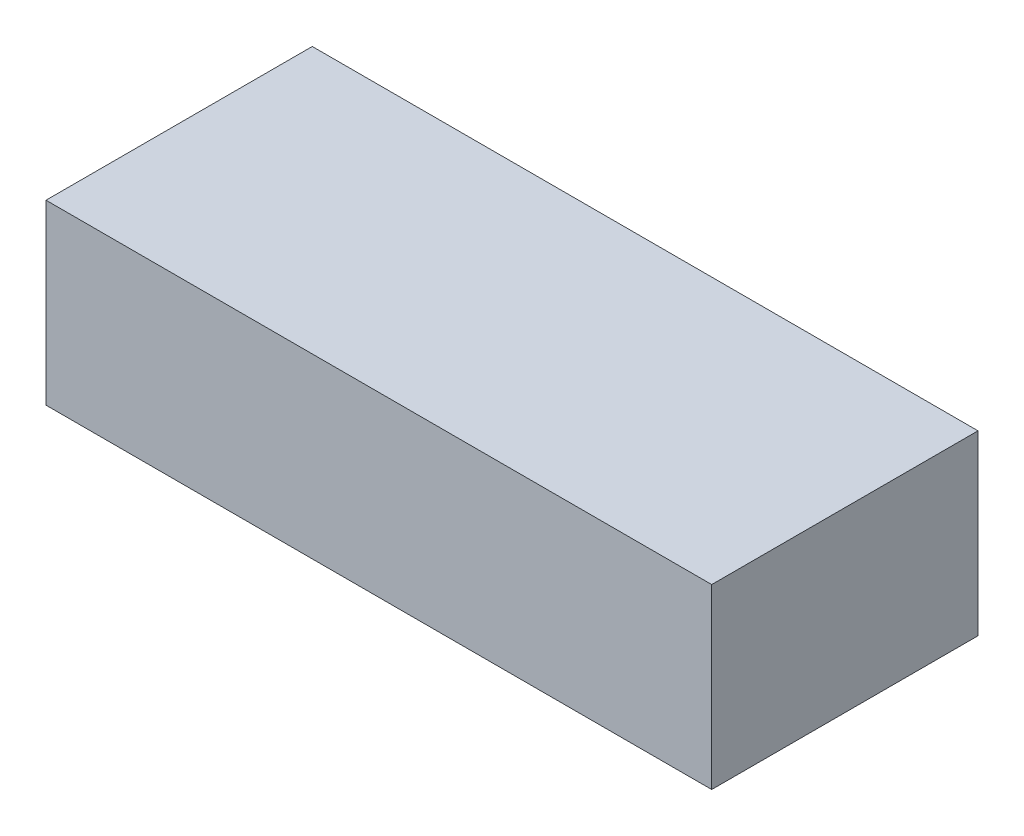
ISO-10303-21;
HEADER;
FILE_DESCRIPTION(('STEP AP214'),'2;1');
FILE_NAME('part.step','',(''),(''),'','','');
FILE_SCHEMA(('AUTOMOTIVE_DESIGN { 1 0 10303 214 1 1 1 1 }'));
ENDSEC;
DATA;
#1=APPLICATION_CONTEXT('core data for automotive mechanical design processes');
#2=APPLICATION_PROTOCOL_DEFINITION('international standard','automotive_design',2000,#1);
#3=PRODUCT_CONTEXT('',#1,'mechanical');
#4=PRODUCT('Part','Part','',(#3));
#5=PRODUCT_RELATED_PRODUCT_CATEGORY('part','',(#4));
#6=PRODUCT_DEFINITION_FORMATION('','',#4);
#7=PRODUCT_DEFINITION_CONTEXT('part definition',#1,'design');
#8=PRODUCT_DEFINITION('design','',#6,#7);
#9=PRODUCT_DEFINITION_SHAPE('','',#8);
#10=(LENGTH_UNIT() NAMED_UNIT(*) SI_UNIT(.MILLI.,.METRE.));
#11=(NAMED_UNIT(*) PLANE_ANGLE_UNIT() SI_UNIT($,.RADIAN.));
#12=(NAMED_UNIT(*) SI_UNIT($,.STERADIAN.) SOLID_ANGLE_UNIT());
#13=UNCERTAINTY_MEASURE_WITH_UNIT(LENGTH_MEASURE(1.E-05),#10,'distance_accuracy_value','');
#14=(GEOMETRIC_REPRESENTATION_CONTEXT(3) GLOBAL_UNCERTAINTY_ASSIGNED_CONTEXT((#13)) GLOBAL_UNIT_ASSIGNED_CONTEXT((#10,
#11,#12)) REPRESENTATION_CONTEXT('',''));
#15=CARTESIAN_POINT('',(0.,0.,0.));
#16=DIRECTION('',(0.,0.,1.));
#17=DIRECTION('',(1.,0.,0.));
#18=AXIS2_PLACEMENT_3D('',#15,#16,#17);
#19=CARTESIAN_POINT('',(0.,40.,0.));
#20=DIRECTION('',(-1.,0.,0.));
#21=DIRECTION('',(0.,0.,1.));
#22=AXIS2_PLACEMENT_3D('',#19,#20,#21);
#23=PLANE('',#22);
#24=DIRECTION('',(0.,0.,-1.));
#25=VECTOR('',#24,1.);
#26=CARTESIAN_POINT('',(0.,0.,0.));
#27=LINE('',#26,#25);
#28=CARTESIAN_POINT('',(0.,0.,60.));
#29=VERTEX_POINT('',#28);
#30=CARTESIAN_POINT('',(0.,0.,0.));
#31=VERTEX_POINT('',#30);
#32=EDGE_CURVE('E98',#29,#31,#27,.T.);
#33=ORIENTED_EDGE('',*,*,#32,.T.);
#34=DIRECTION('',(0.,-1.,0.));
#35=VECTOR('',#34,1.);
#36=CARTESIAN_POINT('',(0.,40.,0.));
#37=LINE('',#36,#35);
#38=CARTESIAN_POINT('',(0.,40.,0.));
#39=VERTEX_POINT('',#38);
#40=EDGE_CURVE('E11',#39,#31,#37,.T.);
#41=ORIENTED_EDGE('',*,*,#40,.F.);
#42=DIRECTION('',(0.,0.,-1.));
#43=VECTOR('',#42,1.);
#44=CARTESIAN_POINT('',(0.,40.,0.));
#45=LINE('',#44,#43);
#46=CARTESIAN_POINT('',(0.,40.,60.));
#47=VERTEX_POINT('',#46);
#48=EDGE_CURVE('E86',#47,#39,#45,.T.);
#49=ORIENTED_EDGE('',*,*,#48,.F.);
#50=DIRECTION('',(0.,-1.,0.));
#51=VECTOR('',#50,1.);
#52=CARTESIAN_POINT('',(0.,40.,60.));
#53=LINE('',#52,#51);
#54=EDGE_CURVE('E94',#47,#29,#53,.T.);
#55=ORIENTED_EDGE('',*,*,#54,.T.);
#56=EDGE_LOOP('',(#33,#41,#49,#55));
#57=FACE_BOUND('',#56,.T.);
#58=ADVANCED_FACE('F35',(#57),#23,.F.);
#59=CARTESIAN_POINT('',(0.,40.,0.));
#60=DIRECTION('',(0.,0.,1.));
#61=DIRECTION('',(1.,0.,0.));
#62=AXIS2_PLACEMENT_3D('',#59,#60,#61);
#63=PLANE('',#62);
#64=DIRECTION('',(-1.,0.,0.));
#65=VECTOR('',#64,1.);
#66=CARTESIAN_POINT('',(0.,0.,0.));
#67=LINE('',#66,#65);
#68=CARTESIAN_POINT('',(-150.,0.,0.));
#69=VERTEX_POINT('',#68);
#70=EDGE_CURVE('E90',#31,#69,#67,.T.);
#71=ORIENTED_EDGE('',*,*,#70,.T.);
#72=DIRECTION('',(0.,-1.,0.));
#73=VECTOR('',#72,1.);
#74=CARTESIAN_POINT('',(-150.,40.,0.));
#75=LINE('',#74,#73);
#76=CARTESIAN_POINT('',(-150.,40.,0.));
#77=VERTEX_POINT('',#76);
#78=EDGE_CURVE('E43',#77,#69,#75,.T.);
#79=ORIENTED_EDGE('',*,*,#78,.F.);
#80=DIRECTION('',(-1.,0.,0.));
#81=VECTOR('',#80,1.);
#82=CARTESIAN_POINT('',(0.,40.,0.));
#83=LINE('',#82,#81);
#84=EDGE_CURVE('E81',#39,#77,#83,.T.);
#85=ORIENTED_EDGE('',*,*,#84,.F.);
#86=ORIENTED_EDGE('',*,*,#40,.T.);
#87=EDGE_LOOP('',(#71,#79,#85,#86));
#88=FACE_BOUND('',#87,.T.);
#89=ADVANCED_FACE('F89',(#88),#63,.F.);
#90=CARTESIAN_POINT('',(-150.,40.,0.));
#91=DIRECTION('',(1.,0.,0.));
#92=DIRECTION('',(0.,0.,-1.));
#93=AXIS2_PLACEMENT_3D('',#90,#91,#92);
#94=PLANE('',#93);
#95=DIRECTION('',(0.,0.,1.));
#96=VECTOR('',#95,1.);
#97=CARTESIAN_POINT('',(-150.,0.,0.));
#98=LINE('',#97,#96);
#99=CARTESIAN_POINT('',(-150.,0.,60.));
#100=VERTEX_POINT('',#99);
#101=EDGE_CURVE('E68',#69,#100,#98,.T.);
#102=ORIENTED_EDGE('',*,*,#101,.T.);
#103=DIRECTION('',(0.,-1.,0.));
#104=VECTOR('',#103,1.);
#105=CARTESIAN_POINT('',(-150.,40.,60.));
#106=LINE('',#105,#104);
#107=CARTESIAN_POINT('',(-150.,40.,60.));
#108=VERTEX_POINT('',#107);
#109=EDGE_CURVE('E91',#108,#100,#106,.T.);
#110=ORIENTED_EDGE('',*,*,#109,.F.);
#111=DIRECTION('',(0.,0.,1.));
#112=VECTOR('',#111,1.);
#113=CARTESIAN_POINT('',(-150.,40.,0.));
#114=LINE('',#113,#112);
#115=EDGE_CURVE('E84',#77,#108,#114,.T.);
#116=ORIENTED_EDGE('',*,*,#115,.F.);
#117=ORIENTED_EDGE('',*,*,#78,.T.);
#118=EDGE_LOOP('',(#102,#110,#116,#117));
#119=FACE_BOUND('',#118,.T.);
#120=ADVANCED_FACE('F92',(#119),#94,.F.);
#121=CARTESIAN_POINT('',(0.,40.,60.));
#122=DIRECTION('',(0.,0.,-1.));
#123=DIRECTION('',(-1.,0.,0.));
#124=AXIS2_PLACEMENT_3D('',#121,#122,#123);
#125=PLANE('',#124);
#126=DIRECTION('',(1.,0.,0.));
#127=VECTOR('',#126,1.);
#128=CARTESIAN_POINT('',(0.,0.,60.));
#129=LINE('',#128,#127);
#130=EDGE_CURVE('E74',#100,#29,#129,.T.);
#131=ORIENTED_EDGE('',*,*,#130,.T.);
#132=ORIENTED_EDGE('',*,*,#54,.F.);
#133=DIRECTION('',(1.,0.,0.));
#134=VECTOR('',#133,1.);
#135=CARTESIAN_POINT('',(0.,40.,60.));
#136=LINE('',#135,#134);
#137=EDGE_CURVE('E51',#108,#47,#136,.T.);
#138=ORIENTED_EDGE('',*,*,#137,.F.);
#139=ORIENTED_EDGE('',*,*,#109,.T.);
#140=EDGE_LOOP('',(#131,#132,#138,#139));
#141=FACE_BOUND('',#140,.T.);
#142=ADVANCED_FACE('F105',(#141),#125,.F.);
#143=CARTESIAN_POINT('',(0.,40.,0.));
#144=DIRECTION('',(0.,-1.,0.));
#145=DIRECTION('',(0.,0.,-1.));
#146=AXIS2_PLACEMENT_3D('',#143,#144,#145);
#147=PLANE('',#146);
#148=ORIENTED_EDGE('',*,*,#48,.T.);
#149=ORIENTED_EDGE('',*,*,#84,.T.);
#150=ORIENTED_EDGE('',*,*,#115,.T.);
#151=ORIENTED_EDGE('',*,*,#137,.T.);
#152=EDGE_LOOP('',(#148,#149,#150,#151));
#153=FACE_BOUND('',#152,.T.);
#154=ADVANCED_FACE('F82',(#153),#147,.F.);
#155=CARTESIAN_POINT('',(0.,0.,0.));
#156=DIRECTION('',(0.,-1.,0.));
#157=DIRECTION('',(0.,0.,-1.));
#158=AXIS2_PLACEMENT_3D('',#155,#156,#157);
#159=PLANE('',#158);
#160=ORIENTED_EDGE('',*,*,#32,.F.);
#161=ORIENTED_EDGE('',*,*,#130,.F.);
#162=ORIENTED_EDGE('',*,*,#101,.F.);
#163=ORIENTED_EDGE('',*,*,#70,.F.);
#164=EDGE_LOOP('',(#160,#161,#162,#163));
#165=FACE_BOUND('',#164,.T.);
#166=ADVANCED_FACE('F108',(#165),#159,.T.);
#167=CLOSED_SHELL('',(#58,#89,#120,#142,#154,#166));
#168=MANIFOLD_SOLID_BREP('B2',#167);
#169=ADVANCED_BREP_SHAPE_REPRESENTATION('',(#18,#168),#14);
#170=SHAPE_DEFINITION_REPRESENTATION(#9,#169);
ENDSEC;
END-ISO-10303-21;
